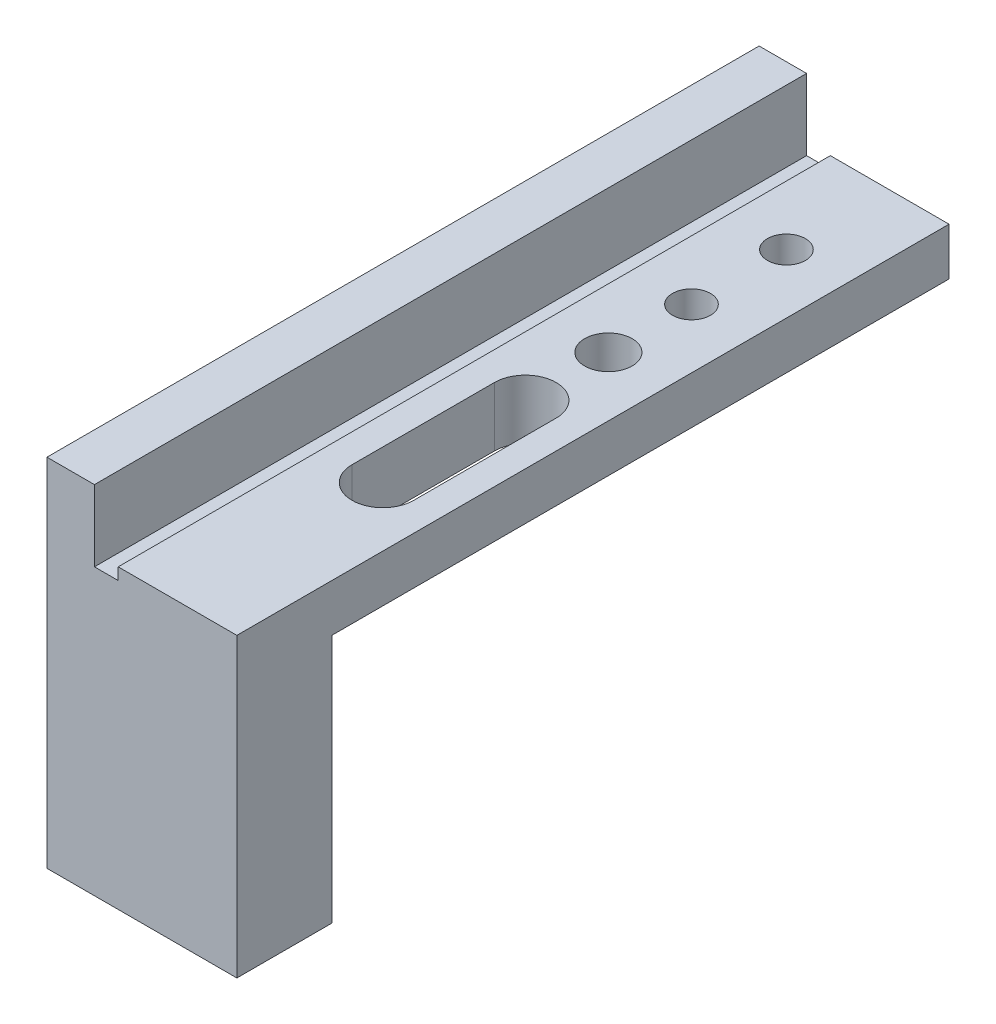
ISO-10303-21;
HEADER;
FILE_DESCRIPTION(('STEP AP214'),'2;1');
FILE_NAME('part.step','',(''),(''),'','','');
FILE_SCHEMA(('AUTOMOTIVE_DESIGN { 1 0 10303 214 1 1 1 1 }'));
ENDSEC;
DATA;
#1=APPLICATION_CONTEXT('core data for automotive mechanical design processes');
#2=APPLICATION_PROTOCOL_DEFINITION('international standard','automotive_design',2000,#1);
#3=PRODUCT_CONTEXT('',#1,'mechanical');
#4=PRODUCT('Part','Part','',(#3));
#5=PRODUCT_RELATED_PRODUCT_CATEGORY('part','',(#4));
#6=PRODUCT_DEFINITION_FORMATION('','',#4);
#7=PRODUCT_DEFINITION_CONTEXT('part definition',#1,'design');
#8=PRODUCT_DEFINITION('design','',#6,#7);
#9=PRODUCT_DEFINITION_SHAPE('','',#8);
#10=(LENGTH_UNIT() NAMED_UNIT(*) SI_UNIT(.MILLI.,.METRE.));
#11=(NAMED_UNIT(*) PLANE_ANGLE_UNIT() SI_UNIT($,.RADIAN.));
#12=(NAMED_UNIT(*) SI_UNIT($,.STERADIAN.) SOLID_ANGLE_UNIT());
#13=UNCERTAINTY_MEASURE_WITH_UNIT(LENGTH_MEASURE(1.E-05),#10,'distance_accuracy_value','');
#14=(GEOMETRIC_REPRESENTATION_CONTEXT(3) GLOBAL_UNCERTAINTY_ASSIGNED_CONTEXT((#13)) GLOBAL_UNIT_ASSIGNED_CONTEXT((#10,
#11,#12)) REPRESENTATION_CONTEXT('',''));
#15=CARTESIAN_POINT('',(0.,0.,0.));
#16=DIRECTION('',(0.,0.,1.));
#17=DIRECTION('',(1.,0.,0.));
#18=AXIS2_PLACEMENT_3D('',#15,#16,#17);
#19=CARTESIAN_POINT('',(-5.15254237288136,-1.99999999999999,30.));
#20=DIRECTION('',(0.,1.,0.));
#21=DIRECTION('',(0.,0.,1.));
#22=AXIS2_PLACEMENT_3D('',#19,#20,#21);
#23=PLANE('',#22);
#24=CARTESIAN_POINT('',(0.347457627118638,-1.99999999999999,11.85));
#25=DIRECTION('',(0.,1.,0.));
#26=DIRECTION('',(0.,0.,1.));
#27=AXIS2_PLACEMENT_3D('',#24,#25,#26);
#28=CIRCLE('',#27,1.);
#29=CARTESIAN_POINT('',(0.347457627118638,-1.99999999999999,12.85));
#30=VERTEX_POINT('',#29);
#31=EDGE_CURVE('E226',#30,#30,#28,.T.);
#32=ORIENTED_EDGE('',*,*,#31,.T.);
#33=EDGE_LOOP('',(#32));
#34=FACE_BOUND('',#33,.T.);
#35=DIRECTION('',(0.,0.,1.));
#36=VECTOR('',#35,1.);
#37=CARTESIAN_POINT('',(-0.952542372881362,-1.99999999999999,30.));
#38=LINE('',#37,#36);
#39=CARTESIAN_POINT('',(-0.952542372881362,-1.99999999999999,15.35));
#40=VERTEX_POINT('',#39);
#41=CARTESIAN_POINT('',(-0.952542372881362,-1.99999999999999,21.35));
#42=VERTEX_POINT('',#41);
#43=EDGE_CURVE('E217',#40,#42,#38,.T.);
#44=ORIENTED_EDGE('',*,*,#43,.T.);
#45=CARTESIAN_POINT('',(0.347457627118638,-1.99999999999999,21.35));
#46=DIRECTION('',(0.,1.,0.));
#47=DIRECTION('',(0.,0.,1.));
#48=AXIS2_PLACEMENT_3D('',#45,#46,#47);
#49=CIRCLE('',#48,1.3);
#50=CARTESIAN_POINT('',(1.64745762711864,-1.99999999999999,21.35));
#51=VERTEX_POINT('',#50);
#52=EDGE_CURVE('E220',#42,#51,#49,.T.);
#53=ORIENTED_EDGE('',*,*,#52,.T.);
#54=DIRECTION('',(0.,0.,-1.));
#55=VECTOR('',#54,1.);
#56=CARTESIAN_POINT('',(1.64745762711864,-1.99999999999999,30.));
#57=LINE('',#56,#55);
#58=CARTESIAN_POINT('',(1.64745762711864,-1.99999999999999,15.35));
#59=VERTEX_POINT('',#58);
#60=EDGE_CURVE('E205',#51,#59,#57,.T.);
#61=ORIENTED_EDGE('',*,*,#60,.T.);
#62=CARTESIAN_POINT('',(0.347457627118638,-1.99999999999999,15.35));
#63=DIRECTION('',(0.,1.,0.));
#64=DIRECTION('',(0.,0.,1.));
#65=AXIS2_PLACEMENT_3D('',#62,#63,#64);
#66=CIRCLE('',#65,1.3);
#67=EDGE_CURVE('E214',#59,#40,#66,.T.);
#68=ORIENTED_EDGE('',*,*,#67,.T.);
#69=EDGE_LOOP('',(#44,#53,#61,#68));
#70=FACE_BOUND('',#69,.T.);
#71=CARTESIAN_POINT('',(0.347457627118638,-1.99999999999999,8.35));
#72=DIRECTION('',(0.,1.,0.));
#73=DIRECTION('',(0.,0.,1.));
#74=AXIS2_PLACEMENT_3D('',#71,#72,#73);
#75=CIRCLE('',#74,0.799999999999997);
#76=CARTESIAN_POINT('',(0.347457627118638,-1.99999999999999,9.15));
#77=VERTEX_POINT('',#76);
#78=EDGE_CURVE('E188',#77,#77,#75,.T.);
#79=ORIENTED_EDGE('',*,*,#78,.T.);
#80=EDGE_LOOP('',(#79));
#81=FACE_BOUND('',#80,.T.);
#82=CARTESIAN_POINT('',(0.347457627118638,-1.99999999999999,4.35));
#83=DIRECTION('',(0.,1.,0.));
#84=DIRECTION('',(0.,0.,1.));
#85=AXIS2_PLACEMENT_3D('',#82,#83,#84);
#86=CIRCLE('',#85,0.799999999999997);
#87=CARTESIAN_POINT('',(0.347457627118638,-1.99999999999999,5.15));
#88=VERTEX_POINT('',#87);
#89=EDGE_CURVE('E182',#88,#88,#86,.T.);
#90=ORIENTED_EDGE('',*,*,#89,.T.);
#91=EDGE_LOOP('',(#90));
#92=FACE_BOUND('',#91,.T.);
#93=DIRECTION('',(1.,0.,0.));
#94=VECTOR('',#93,1.);
#95=CARTESIAN_POINT('',(2.84745762711864,-1.99999999999999,26.));
#96=LINE('',#95,#94);
#97=CARTESIAN_POINT('',(-4.65254237288136,-1.99999999999999,26.));
#98=VERTEX_POINT('',#97);
#99=CARTESIAN_POINT('',(2.34745762711864,-1.99999999999999,26.));
#100=VERTEX_POINT('',#99);
#101=EDGE_CURVE('E170',#98,#100,#96,.T.);
#102=ORIENTED_EDGE('',*,*,#101,.F.);
#103=DIRECTION('',(0.,0.,-1.));
#104=VECTOR('',#103,1.);
#105=CARTESIAN_POINT('',(-4.65254237288136,-1.99999999999999,30.));
#106=LINE('',#105,#104);
#107=CARTESIAN_POINT('',(-4.65254237288136,-1.99999999999999,0.));
#108=VERTEX_POINT('',#107);
#109=EDGE_CURVE('E275',#98,#108,#106,.T.);
#110=ORIENTED_EDGE('',*,*,#109,.T.);
#111=DIRECTION('',(1.,0.,0.));
#112=VECTOR('',#111,1.);
#113=CARTESIAN_POINT('',(-5.15254237288136,-1.99999999999999,0.));
#114=LINE('',#113,#112);
#115=CARTESIAN_POINT('',(2.34745762711864,-1.99999999999999,0.));
#116=VERTEX_POINT('',#115);
#117=EDGE_CURVE('E244',#108,#116,#114,.T.);
#118=ORIENTED_EDGE('',*,*,#117,.T.);
#119=DIRECTION('',(0.,0.,1.));
#120=VECTOR('',#119,1.);
#121=CARTESIAN_POINT('',(2.34745762711864,-1.99999999999999,30.));
#122=LINE('',#121,#120);
#123=EDGE_CURVE('E273',#116,#100,#122,.T.);
#124=ORIENTED_EDGE('',*,*,#123,.T.);
#125=EDGE_LOOP('',(#102,#110,#118,#124));
#126=FACE_BOUND('',#125,.T.);
#127=ADVANCED_FACE('F35',(#34,#70,#81,#92,#126),#23,.F.);
#128=CARTESIAN_POINT('',(-5.15254237288136,3.00000000000001,30.));
#129=DIRECTION('',(1.,0.,0.));
#130=DIRECTION('',(0.,1.,0.));
#131=AXIS2_PLACEMENT_3D('',#128,#129,#130);
#132=PLANE('',#131);
#133=DIRECTION('',(0.,-1.,0.));
#134=VECTOR('',#133,1.);
#135=CARTESIAN_POINT('',(-5.15254237288136,3.00000000000001,0.));
#136=LINE('',#135,#134);
#137=CARTESIAN_POINT('',(-5.15254237288136,3.00000000000001,0.));
#138=VERTEX_POINT('',#137);
#139=CARTESIAN_POINT('',(-5.15254237288136,-1.49999999999999,0.));
#140=VERTEX_POINT('',#139);
#141=EDGE_CURVE('E229',#138,#140,#136,.T.);
#142=ORIENTED_EDGE('',*,*,#141,.T.);
#143=DIRECTION('',(0.,0.,1.));
#144=VECTOR('',#143,1.);
#145=CARTESIAN_POINT('',(-5.15254237288136,-1.49999999999999,30.));
#146=LINE('',#145,#144);
#147=CARTESIAN_POINT('',(-5.15254237288136,-1.49999999999999,26.));
#148=VERTEX_POINT('',#147);
#149=EDGE_CURVE('E282',#140,#148,#146,.T.);
#150=ORIENTED_EDGE('',*,*,#149,.T.);
#151=DIRECTION('',(0.,1.,0.));
#152=VECTOR('',#151,1.);
#153=CARTESIAN_POINT('',(-5.15254237288136,-12.,26.));
#154=LINE('',#153,#152);
#155=CARTESIAN_POINT('',(-5.15254237288136,-12.,26.));
#156=VERTEX_POINT('',#155);
#157=EDGE_CURVE('E57',#156,#148,#154,.T.);
#158=ORIENTED_EDGE('',*,*,#157,.F.);
#159=DIRECTION('',(0.,0.,-1.));
#160=VECTOR('',#159,1.);
#161=CARTESIAN_POINT('',(-5.15254237288136,-12.,30.));
#162=LINE('',#161,#160);
#163=CARTESIAN_POINT('',(-5.15254237288136,-12.,30.));
#164=VERTEX_POINT('',#163);
#165=EDGE_CURVE('E166',#164,#156,#162,.T.);
#166=ORIENTED_EDGE('',*,*,#165,.F.);
#167=DIRECTION('',(0.,-1.,0.));
#168=VECTOR('',#167,1.);
#169=CARTESIAN_POINT('',(-5.15254237288136,3.00000000000001,30.));
#170=LINE('',#169,#168);
#171=CARTESIAN_POINT('',(-5.15254237288136,3.00000000000001,30.));
#172=VERTEX_POINT('',#171);
#173=EDGE_CURVE('E158',#172,#164,#170,.T.);
#174=ORIENTED_EDGE('',*,*,#173,.F.);
#175=DIRECTION('',(0.,0.,-1.));
#176=VECTOR('',#175,1.);
#177=CARTESIAN_POINT('',(-5.15254237288136,3.00000000000001,30.));
#178=LINE('',#177,#176);
#179=EDGE_CURVE('E241',#172,#138,#178,.T.);
#180=ORIENTED_EDGE('',*,*,#179,.T.);
#181=EDGE_LOOP('',(#142,#150,#158,#166,#174,#180));
#182=FACE_BOUND('',#181,.T.);
#183=ADVANCED_FACE('F301',(#182),#132,.F.);
#184=CARTESIAN_POINT('',(2.84745762711864,-1.99999999999999,30.));
#185=DIRECTION('',(-1.,0.,0.));
#186=DIRECTION('',(0.,-1.,0.));
#187=AXIS2_PLACEMENT_3D('',#184,#185,#186);
#188=PLANE('',#187);
#189=DIRECTION('',(0.,1.,0.));
#190=VECTOR('',#189,1.);
#191=CARTESIAN_POINT('',(2.84745762711864,-12.,26.));
#192=LINE('',#191,#190);
#193=CARTESIAN_POINT('',(2.84745762711864,-12.,26.));
#194=VERTEX_POINT('',#193);
#195=CARTESIAN_POINT('',(2.84745762711864,-1.5,26.));
#196=VERTEX_POINT('',#195);
#197=EDGE_CURVE('E50',#194,#196,#192,.T.);
#198=ORIENTED_EDGE('',*,*,#197,.T.);
#199=DIRECTION('',(0.,0.,-1.));
#200=VECTOR('',#199,1.);
#201=CARTESIAN_POINT('',(2.84745762711864,-1.5,30.));
#202=LINE('',#201,#200);
#203=CARTESIAN_POINT('',(2.84745762711864,-1.5,0.));
#204=VERTEX_POINT('',#203);
#205=EDGE_CURVE('E284',#196,#204,#202,.T.);
#206=ORIENTED_EDGE('',*,*,#205,.T.);
#207=DIRECTION('',(0.,1.,0.));
#208=VECTOR('',#207,1.);
#209=CARTESIAN_POINT('',(2.84745762711864,-1.99999999999999,0.));
#210=LINE('',#209,#208);
#211=CARTESIAN_POINT('',(2.84745762711864,0.500000000000006,0.));
#212=VERTEX_POINT('',#211);
#213=EDGE_CURVE('E247',#204,#212,#210,.T.);
#214=ORIENTED_EDGE('',*,*,#213,.T.);
#215=DIRECTION('',(0.,0.,-1.));
#216=VECTOR('',#215,1.);
#217=CARTESIAN_POINT('',(2.84745762711864,0.500000000000006,30.));
#218=LINE('',#217,#216);
#219=CARTESIAN_POINT('',(2.84745762711864,0.500000000000006,30.));
#220=VERTEX_POINT('',#219);
#221=EDGE_CURVE('E154',#220,#212,#218,.T.);
#222=ORIENTED_EDGE('',*,*,#221,.F.);
#223=DIRECTION('',(0.,1.,0.));
#224=VECTOR('',#223,1.);
#225=CARTESIAN_POINT('',(2.84745762711864,-1.99999999999999,30.));
#226=LINE('',#225,#224);
#227=CARTESIAN_POINT('',(2.84745762711864,-12.,30.));
#228=VERTEX_POINT('',#227);
#229=EDGE_CURVE('E148',#228,#220,#226,.T.);
#230=ORIENTED_EDGE('',*,*,#229,.F.);
#231=DIRECTION('',(0.,0.,1.));
#232=VECTOR('',#231,1.);
#233=CARTESIAN_POINT('',(2.84745762711864,-12.,30.));
#234=LINE('',#233,#232);
#235=EDGE_CURVE('E152',#194,#228,#234,.T.);
#236=ORIENTED_EDGE('',*,*,#235,.F.);
#237=EDGE_LOOP('',(#198,#206,#214,#222,#230,#236));
#238=FACE_BOUND('',#237,.T.);
#239=ADVANCED_FACE('F150',(#238),#188,.F.);
#240=CARTESIAN_POINT('',(-2.15254237288136,0.500000000000005,30.));
#241=DIRECTION('',(0.,-1.,0.));
#242=DIRECTION('',(1.,0.,0.));
#243=AXIS2_PLACEMENT_3D('',#240,#241,#242);
#244=PLANE('',#243);
#245=CARTESIAN_POINT('',(0.347457627118638,0.500000000000006,4.35));
#246=DIRECTION('',(0.,1.,0.));
#247=DIRECTION('',(0.,0.,1.));
#248=AXIS2_PLACEMENT_3D('',#245,#246,#247);
#249=CIRCLE('',#248,0.799999999999998);
#250=CARTESIAN_POINT('',(0.347457627118638,0.500000000000006,5.15));
#251=VERTEX_POINT('',#250);
#252=EDGE_CURVE('E179',#251,#251,#249,.T.);
#253=ORIENTED_EDGE('',*,*,#252,.F.);
#254=EDGE_LOOP('',(#253));
#255=FACE_BOUND('',#254,.T.);
#256=CARTESIAN_POINT('',(0.347457627118638,0.500000000000006,8.35));
#257=DIRECTION('',(0.,1.,0.));
#258=DIRECTION('',(0.,0.,1.));
#259=AXIS2_PLACEMENT_3D('',#256,#257,#258);
#260=CIRCLE('',#259,0.799999999999998);
#261=CARTESIAN_POINT('',(0.347457627118638,0.500000000000006,9.15));
#262=VERTEX_POINT('',#261);
#263=EDGE_CURVE('E185',#262,#262,#260,.T.);
#264=ORIENTED_EDGE('',*,*,#263,.F.);
#265=EDGE_LOOP('',(#264));
#266=FACE_BOUND('',#265,.T.);
#267=DIRECTION('',(0.,0.,-1.));
#268=VECTOR('',#267,1.);
#269=CARTESIAN_POINT('',(1.64745762711864,0.500000000000006,21.35));
#270=LINE('',#269,#268);
#271=CARTESIAN_POINT('',(1.64745762711864,0.500000000000006,21.35));
#272=VERTEX_POINT('',#271);
#273=CARTESIAN_POINT('',(1.64745762711864,0.500000000000006,15.35));
#274=VERTEX_POINT('',#273);
#275=EDGE_CURVE('E193',#272,#274,#270,.T.);
#276=ORIENTED_EDGE('',*,*,#275,.F.);
#277=CARTESIAN_POINT('',(0.347457627118638,0.500000000000006,21.35));
#278=DIRECTION('',(0.,1.,0.));
#279=DIRECTION('',(-1.,0.,0.));
#280=AXIS2_PLACEMENT_3D('',#277,#278,#279);
#281=CIRCLE('',#280,1.3);
#282=CARTESIAN_POINT('',(-0.952542372881362,0.500000000000005,21.35));
#283=VERTEX_POINT('',#282);
#284=EDGE_CURVE('E191',#283,#272,#281,.T.);
#285=ORIENTED_EDGE('',*,*,#284,.F.);
#286=DIRECTION('',(0.,0.,1.));
#287=VECTOR('',#286,1.);
#288=CARTESIAN_POINT('',(-0.952542372881362,0.500000000000005,21.35));
#289=LINE('',#288,#287);
#290=CARTESIAN_POINT('',(-0.952542372881362,0.500000000000005,15.35));
#291=VERTEX_POINT('',#290);
#292=EDGE_CURVE('E199',#291,#283,#289,.T.);
#293=ORIENTED_EDGE('',*,*,#292,.F.);
#294=CARTESIAN_POINT('',(0.347457627118638,0.500000000000006,15.35));
#295=DIRECTION('',(0.,1.,0.));
#296=DIRECTION('',(-1.,0.,0.));
#297=AXIS2_PLACEMENT_3D('',#294,#295,#296);
#298=CIRCLE('',#297,1.3);
#299=EDGE_CURVE('E196',#274,#291,#298,.T.);
#300=ORIENTED_EDGE('',*,*,#299,.F.);
#301=EDGE_LOOP('',(#276,#285,#293,#300));
#302=FACE_BOUND('',#301,.T.);
#303=CARTESIAN_POINT('',(0.347457627118638,0.500000000000006,11.85));
#304=DIRECTION('',(0.,1.,0.));
#305=DIRECTION('',(-1.,0.,0.));
#306=AXIS2_PLACEMENT_3D('',#303,#304,#305);
#307=CIRCLE('',#306,1.);
#308=CARTESIAN_POINT('',(-0.652542372881363,0.500000000000005,11.85));
#309=VERTEX_POINT('',#308);
#310=EDGE_CURVE('E223',#309,#309,#307,.T.);
#311=ORIENTED_EDGE('',*,*,#310,.F.);
#312=EDGE_LOOP('',(#311));
#313=FACE_BOUND('',#312,.T.);
#314=DIRECTION('',(-1.,0.,0.));
#315=VECTOR('',#314,1.);
#316=CARTESIAN_POINT('',(-2.15254237288136,0.500000000000005,0.));
#317=LINE('',#316,#315);
#318=CARTESIAN_POINT('',(-2.15254237288136,0.500000000000005,0.));
#319=VERTEX_POINT('',#318);
#320=EDGE_CURVE('E249',#212,#319,#317,.T.);
#321=ORIENTED_EDGE('',*,*,#320,.T.);
#322=DIRECTION('',(0.,0.,-1.));
#323=VECTOR('',#322,1.);
#324=CARTESIAN_POINT('',(-2.15254237288136,0.500000000000005,30.));
#325=LINE('',#324,#323);
#326=CARTESIAN_POINT('',(-2.15254237288136,0.500000000000005,30.));
#327=VERTEX_POINT('',#326);
#328=EDGE_CURVE('E269',#327,#319,#325,.T.);
#329=ORIENTED_EDGE('',*,*,#328,.F.);
#330=DIRECTION('',(-1.,0.,0.));
#331=VECTOR('',#330,1.);
#332=CARTESIAN_POINT('',(-2.15254237288136,0.500000000000005,30.));
#333=LINE('',#332,#331);
#334=EDGE_CURVE('E157',#220,#327,#333,.T.);
#335=ORIENTED_EDGE('',*,*,#334,.F.);
#336=ORIENTED_EDGE('',*,*,#221,.T.);
#337=EDGE_LOOP('',(#321,#329,#335,#336));
#338=FACE_BOUND('',#337,.T.);
#339=ADVANCED_FACE('F325',(#255,#266,#302,#313,#338),#244,.F.);
#340=CARTESIAN_POINT('',(-2.15254237288136,0.,30.));
#341=DIRECTION('',(1.,0.,0.));
#342=DIRECTION('',(0.,0.,-1.));
#343=AXIS2_PLACEMENT_3D('',#340,#341,#342);
#344=PLANE('',#343);
#345=DIRECTION('',(0.,-1.,0.));
#346=VECTOR('',#345,1.);
#347=CARTESIAN_POINT('',(-2.15254237288136,0.,0.));
#348=LINE('',#347,#346);
#349=CARTESIAN_POINT('',(-2.15254237288136,0.,0.));
#350=VERTEX_POINT('',#349);
#351=EDGE_CURVE('E251',#319,#350,#348,.T.);
#352=ORIENTED_EDGE('',*,*,#351,.T.);
#353=DIRECTION('',(0.,0.,-1.));
#354=VECTOR('',#353,1.);
#355=CARTESIAN_POINT('',(-2.15254237288136,0.,30.));
#356=LINE('',#355,#354);
#357=CARTESIAN_POINT('',(-2.15254237288136,0.,30.));
#358=VERTEX_POINT('',#357);
#359=EDGE_CURVE('E266',#358,#350,#356,.T.);
#360=ORIENTED_EDGE('',*,*,#359,.F.);
#361=DIRECTION('',(0.,-1.,0.));
#362=VECTOR('',#361,1.);
#363=CARTESIAN_POINT('',(-2.15254237288136,0.,30.));
#364=LINE('',#363,#362);
#365=EDGE_CURVE('E233',#327,#358,#364,.T.);
#366=ORIENTED_EDGE('',*,*,#365,.F.);
#367=ORIENTED_EDGE('',*,*,#328,.T.);
#368=EDGE_LOOP('',(#352,#360,#366,#367));
#369=FACE_BOUND('',#368,.T.);
#370=ADVANCED_FACE('F320',(#369),#344,.F.);
#371=CARTESIAN_POINT('',(-3.15254237288136,0.,30.));
#372=DIRECTION('',(0.,-1.,0.));
#373=DIRECTION('',(0.,0.,-1.));
#374=AXIS2_PLACEMENT_3D('',#371,#372,#373);
#375=PLANE('',#374);
#376=DIRECTION('',(-1.,0.,0.));
#377=VECTOR('',#376,1.);
#378=CARTESIAN_POINT('',(-3.15254237288136,0.,0.));
#379=LINE('',#378,#377);
#380=CARTESIAN_POINT('',(-3.15254237288136,0.,0.));
#381=VERTEX_POINT('',#380);
#382=EDGE_CURVE('E253',#350,#381,#379,.T.);
#383=ORIENTED_EDGE('',*,*,#382,.T.);
#384=DIRECTION('',(0.,0.,-1.));
#385=VECTOR('',#384,1.);
#386=CARTESIAN_POINT('',(-3.15254237288136,0.,30.));
#387=LINE('',#386,#385);
#388=CARTESIAN_POINT('',(-3.15254237288136,0.,30.));
#389=VERTEX_POINT('',#388);
#390=EDGE_CURVE('E263',#389,#381,#387,.T.);
#391=ORIENTED_EDGE('',*,*,#390,.F.);
#392=DIRECTION('',(-1.,0.,0.));
#393=VECTOR('',#392,1.);
#394=CARTESIAN_POINT('',(-3.15254237288136,0.,30.));
#395=LINE('',#394,#393);
#396=EDGE_CURVE('E235',#358,#389,#395,.T.);
#397=ORIENTED_EDGE('',*,*,#396,.F.);
#398=ORIENTED_EDGE('',*,*,#359,.T.);
#399=EDGE_LOOP('',(#383,#391,#397,#398));
#400=FACE_BOUND('',#399,.T.);
#401=ADVANCED_FACE('F316',(#400),#375,.F.);
#402=CARTESIAN_POINT('',(-3.15254237288136,3.00000000000001,30.));
#403=DIRECTION('',(-1.,0.,0.));
#404=DIRECTION('',(0.,-1.,0.));
#405=AXIS2_PLACEMENT_3D('',#402,#403,#404);
#406=PLANE('',#405);
#407=DIRECTION('',(0.,1.,0.));
#408=VECTOR('',#407,1.);
#409=CARTESIAN_POINT('',(-3.15254237288136,3.00000000000001,0.));
#410=LINE('',#409,#408);
#411=CARTESIAN_POINT('',(-3.15254237288136,3.00000000000001,0.));
#412=VERTEX_POINT('',#411);
#413=EDGE_CURVE('E255',#381,#412,#410,.T.);
#414=ORIENTED_EDGE('',*,*,#413,.T.);
#415=DIRECTION('',(0.,0.,-1.));
#416=VECTOR('',#415,1.);
#417=CARTESIAN_POINT('',(-3.15254237288136,3.00000000000001,30.));
#418=LINE('',#417,#416);
#419=CARTESIAN_POINT('',(-3.15254237288136,3.00000000000001,30.));
#420=VERTEX_POINT('',#419);
#421=EDGE_CURVE('E260',#420,#412,#418,.T.);
#422=ORIENTED_EDGE('',*,*,#421,.F.);
#423=DIRECTION('',(0.,1.,0.));
#424=VECTOR('',#423,1.);
#425=CARTESIAN_POINT('',(-3.15254237288136,3.00000000000001,30.));
#426=LINE('',#425,#424);
#427=EDGE_CURVE('E237',#389,#420,#426,.T.);
#428=ORIENTED_EDGE('',*,*,#427,.F.);
#429=ORIENTED_EDGE('',*,*,#390,.T.);
#430=EDGE_LOOP('',(#414,#422,#428,#429));
#431=FACE_BOUND('',#430,.T.);
#432=ADVANCED_FACE('F311',(#431),#406,.F.);
#433=CARTESIAN_POINT('',(-5.15254237288136,3.00000000000001,30.));
#434=DIRECTION('',(0.,-1.,0.));
#435=DIRECTION('',(0.,0.,-1.));
#436=AXIS2_PLACEMENT_3D('',#433,#434,#435);
#437=PLANE('',#436);
#438=DIRECTION('',(-1.,0.,0.));
#439=VECTOR('',#438,1.);
#440=CARTESIAN_POINT('',(-5.15254237288136,3.00000000000001,0.));
#441=LINE('',#440,#439);
#442=EDGE_CURVE('E230',#412,#138,#441,.T.);
#443=ORIENTED_EDGE('',*,*,#442,.T.);
#444=ORIENTED_EDGE('',*,*,#179,.F.);
#445=DIRECTION('',(-1.,0.,0.));
#446=VECTOR('',#445,1.);
#447=CARTESIAN_POINT('',(-5.15254237288136,3.00000000000001,30.));
#448=LINE('',#447,#446);
#449=EDGE_CURVE('E239',#420,#172,#448,.T.);
#450=ORIENTED_EDGE('',*,*,#449,.F.);
#451=ORIENTED_EDGE('',*,*,#421,.T.);
#452=EDGE_LOOP('',(#443,#444,#450,#451));
#453=FACE_BOUND('',#452,.T.);
#454=ADVANCED_FACE('F305',(#453),#437,.F.);
#455=CARTESIAN_POINT('',(0.,0.,30.));
#456=DIRECTION('',(0.,0.,1.));
#457=DIRECTION('',(1.,0.,0.));
#458=AXIS2_PLACEMENT_3D('',#455,#456,#457);
#459=PLANE('',#458);
#460=ORIENTED_EDGE('',*,*,#173,.T.);
#461=DIRECTION('',(-1.,0.,0.));
#462=VECTOR('',#461,1.);
#463=CARTESIAN_POINT('',(2.84745762711864,-12.,30.));
#464=LINE('',#463,#462);
#465=EDGE_CURVE('E161',#228,#164,#464,.T.);
#466=ORIENTED_EDGE('',*,*,#465,.F.);
#467=ORIENTED_EDGE('',*,*,#229,.T.);
#468=ORIENTED_EDGE('',*,*,#334,.T.);
#469=ORIENTED_EDGE('',*,*,#365,.T.);
#470=ORIENTED_EDGE('',*,*,#396,.T.);
#471=ORIENTED_EDGE('',*,*,#427,.T.);
#472=ORIENTED_EDGE('',*,*,#449,.T.);
#473=EDGE_LOOP('',(#460,#466,#467,#468,#469,#470,#471,#472));
#474=FACE_BOUND('',#473,.T.);
#475=ADVANCED_FACE('F162',(#474),#459,.T.);
#476=CARTESIAN_POINT('',(0.,0.,0.));
#477=DIRECTION('',(0.,0.,1.));
#478=DIRECTION('',(1.,0.,0.));
#479=AXIS2_PLACEMENT_3D('',#476,#477,#478);
#480=PLANE('',#479);
#481=ORIENTED_EDGE('',*,*,#117,.F.);
#482=DIRECTION('',(0.707106781186545,-0.70710678118655,0.));
#483=VECTOR('',#482,1.);
#484=CARTESIAN_POINT('',(-4.65254237288136,-1.99999999999999,0.));
#485=LINE('',#484,#483);
#486=EDGE_CURVE('E280',#108,#140,#485,.F.);
#487=ORIENTED_EDGE('',*,*,#486,.T.);
#488=ORIENTED_EDGE('',*,*,#141,.F.);
#489=ORIENTED_EDGE('',*,*,#442,.F.);
#490=ORIENTED_EDGE('',*,*,#413,.F.);
#491=ORIENTED_EDGE('',*,*,#382,.F.);
#492=ORIENTED_EDGE('',*,*,#351,.F.);
#493=ORIENTED_EDGE('',*,*,#320,.F.);
#494=ORIENTED_EDGE('',*,*,#213,.F.);
#495=DIRECTION('',(0.70710678118655,0.707106781186545,0.));
#496=VECTOR('',#495,1.);
#497=CARTESIAN_POINT('',(2.84745762711864,-1.5,0.));
#498=LINE('',#497,#496);
#499=EDGE_CURVE('E278',#204,#116,#498,.F.);
#500=ORIENTED_EDGE('',*,*,#499,.T.);
#501=EDGE_LOOP('',(#481,#487,#488,#489,#490,#491,#492,#493,#494,#500));
#502=FACE_BOUND('',#501,.T.);
#503=ADVANCED_FACE('F298',(#502),#480,.F.);
#504=CARTESIAN_POINT('',(0.34745762711864,-9.49999999999999,11.85));
#505=DIRECTION('',(0.,1.,0.));
#506=DIRECTION('',(-1.,0.,0.));
#507=AXIS2_PLACEMENT_3D('',#504,#505,#506);
#508=CYLINDRICAL_SURFACE('',#507,1.);
#509=ORIENTED_EDGE('',*,*,#310,.T.);
#510=EDGE_LOOP('',(#509));
#511=FACE_BOUND('',#510,.T.);
#512=ORIENTED_EDGE('',*,*,#31,.F.);
#513=EDGE_LOOP('',(#512));
#514=FACE_BOUND('',#513,.T.);
#515=ADVANCED_FACE('F380',(#511,#514),#508,.F.);
#516=CARTESIAN_POINT('',(0.34745762711864,-9.49999999999999,21.35));
#517=DIRECTION('',(0.,1.,0.));
#518=DIRECTION('',(-1.,0.,0.));
#519=AXIS2_PLACEMENT_3D('',#516,#517,#518);
#520=CYLINDRICAL_SURFACE('',#519,1.3);
#521=DIRECTION('',(0.,1.,0.));
#522=VECTOR('',#521,1.);
#523=CARTESIAN_POINT('',(-0.95254237288136,-9.49999999999999,21.35));
#524=LINE('',#523,#522);
#525=EDGE_CURVE('E203',#42,#283,#524,.T.);
#526=ORIENTED_EDGE('',*,*,#525,.T.);
#527=ORIENTED_EDGE('',*,*,#284,.T.);
#528=DIRECTION('',(0.,1.,0.));
#529=VECTOR('',#528,1.);
#530=CARTESIAN_POINT('',(1.64745762711864,-9.49999999999999,21.35));
#531=LINE('',#530,#529);
#532=EDGE_CURVE('E202',#51,#272,#531,.T.);
#533=ORIENTED_EDGE('',*,*,#532,.F.);
#534=ORIENTED_EDGE('',*,*,#52,.F.);
#535=EDGE_LOOP('',(#526,#527,#533,#534));
#536=FACE_BOUND('',#535,.T.);
#537=ADVANCED_FACE('F370',(#536),#520,.F.);
#538=CARTESIAN_POINT('',(-0.95254237288136,-9.49999999999999,21.35));
#539=DIRECTION('',(-1.,0.,0.));
#540=DIRECTION('',(0.,-1.,0.));
#541=AXIS2_PLACEMENT_3D('',#538,#539,#540);
#542=PLANE('',#541);
#543=DIRECTION('',(0.,1.,0.));
#544=VECTOR('',#543,1.);
#545=CARTESIAN_POINT('',(-0.95254237288136,-9.49999999999999,15.35));
#546=LINE('',#545,#544);
#547=EDGE_CURVE('E206',#40,#291,#546,.T.);
#548=ORIENTED_EDGE('',*,*,#547,.T.);
#549=ORIENTED_EDGE('',*,*,#292,.T.);
#550=ORIENTED_EDGE('',*,*,#525,.F.);
#551=ORIENTED_EDGE('',*,*,#43,.F.);
#552=EDGE_LOOP('',(#548,#549,#550,#551));
#553=FACE_BOUND('',#552,.T.);
#554=ADVANCED_FACE('F366',(#553),#542,.F.);
#555=CARTESIAN_POINT('',(0.34745762711864,-9.49999999999999,15.35));
#556=DIRECTION('',(0.,1.,0.));
#557=DIRECTION('',(-1.,0.,0.));
#558=AXIS2_PLACEMENT_3D('',#555,#556,#557);
#559=CYLINDRICAL_SURFACE('',#558,1.3);
#560=DIRECTION('',(0.,1.,0.));
#561=VECTOR('',#560,1.);
#562=CARTESIAN_POINT('',(1.64745762711864,-9.49999999999999,15.35));
#563=LINE('',#562,#561);
#564=EDGE_CURVE('E208',#59,#274,#563,.T.);
#565=ORIENTED_EDGE('',*,*,#564,.T.);
#566=ORIENTED_EDGE('',*,*,#299,.T.);
#567=ORIENTED_EDGE('',*,*,#547,.F.);
#568=ORIENTED_EDGE('',*,*,#67,.F.);
#569=EDGE_LOOP('',(#565,#566,#567,#568));
#570=FACE_BOUND('',#569,.T.);
#571=ADVANCED_FACE('F369',(#570),#559,.F.);
#572=CARTESIAN_POINT('',(1.64745762711864,-9.49999999999999,21.35));
#573=DIRECTION('',(1.,0.,0.));
#574=DIRECTION('',(0.,1.,0.));
#575=AXIS2_PLACEMENT_3D('',#572,#573,#574);
#576=PLANE('',#575);
#577=ORIENTED_EDGE('',*,*,#532,.T.);
#578=ORIENTED_EDGE('',*,*,#275,.T.);
#579=ORIENTED_EDGE('',*,*,#564,.F.);
#580=ORIENTED_EDGE('',*,*,#60,.F.);
#581=EDGE_LOOP('',(#577,#578,#579,#580));
#582=FACE_BOUND('',#581,.T.);
#583=ADVANCED_FACE('F364',(#582),#576,.F.);
#584=CARTESIAN_POINT('',(0.347457627118638,0.500000000000006,8.35));
#585=DIRECTION('',(0.,1.,0.));
#586=DIRECTION('',(0.,0.,1.));
#587=AXIS2_PLACEMENT_3D('',#584,#585,#586);
#588=CYLINDRICAL_SURFACE('',#587,0.799999999999997);
#589=ORIENTED_EDGE('',*,*,#263,.T.);
#590=EDGE_LOOP('',(#589));
#591=FACE_BOUND('',#590,.T.);
#592=ORIENTED_EDGE('',*,*,#78,.F.);
#593=EDGE_LOOP('',(#592));
#594=FACE_BOUND('',#593,.T.);
#595=ADVANCED_FACE('F360',(#591,#594),#588,.F.);
#596=CARTESIAN_POINT('',(0.347457627118638,0.500000000000006,4.35));
#597=DIRECTION('',(0.,1.,0.));
#598=DIRECTION('',(0.,0.,1.));
#599=AXIS2_PLACEMENT_3D('',#596,#597,#598);
#600=CYLINDRICAL_SURFACE('',#599,0.799999999999997);
#601=ORIENTED_EDGE('',*,*,#252,.T.);
#602=EDGE_LOOP('',(#601));
#603=FACE_BOUND('',#602,.T.);
#604=ORIENTED_EDGE('',*,*,#89,.F.);
#605=EDGE_LOOP('',(#604));
#606=FACE_BOUND('',#605,.T.);
#607=ADVANCED_FACE('F355',(#603,#606),#600,.F.);
#608=CARTESIAN_POINT('',(2.84745762711864,-12.,26.));
#609=DIRECTION('',(0.,0.,1.));
#610=DIRECTION('',(1.,0.,0.));
#611=AXIS2_PLACEMENT_3D('',#608,#609,#610);
#612=PLANE('',#611);
#613=ORIENTED_EDGE('',*,*,#157,.T.);
#614=DIRECTION('',(-0.707106781186545,0.70710678118655,0.));
#615=VECTOR('',#614,1.);
#616=CARTESIAN_POINT('',(4.09745762711861,-10.75,26.));
#617=LINE('',#616,#615);
#618=EDGE_CURVE('E43',#148,#98,#617,.F.);
#619=ORIENTED_EDGE('',*,*,#618,.T.);
#620=ORIENTED_EDGE('',*,*,#101,.T.);
#621=DIRECTION('',(-0.70710678118655,-0.707106781186545,0.));
#622=VECTOR('',#621,1.);
#623=CARTESIAN_POINT('',(-2.40254237288136,-6.74999999999996,26.));
#624=LINE('',#623,#622);
#625=EDGE_CURVE('E11',#100,#196,#624,.F.);
#626=ORIENTED_EDGE('',*,*,#625,.T.);
#627=ORIENTED_EDGE('',*,*,#197,.F.);
#628=DIRECTION('',(1.,0.,0.));
#629=VECTOR('',#628,1.);
#630=CARTESIAN_POINT('',(2.84745762711864,-12.,26.));
#631=LINE('',#630,#629);
#632=EDGE_CURVE('E169',#156,#194,#631,.T.);
#633=ORIENTED_EDGE('',*,*,#632,.F.);
#634=EDGE_LOOP('',(#613,#619,#620,#626,#627,#633));
#635=FACE_BOUND('',#634,.T.);
#636=ADVANCED_FACE('F287',(#635),#612,.F.);
#637=CARTESIAN_POINT('',(0.,-12.,0.));
#638=DIRECTION('',(0.,1.,0.));
#639=DIRECTION('',(0.,0.,1.));
#640=AXIS2_PLACEMENT_3D('',#637,#638,#639);
#641=PLANE('',#640);
#642=ORIENTED_EDGE('',*,*,#235,.T.);
#643=ORIENTED_EDGE('',*,*,#465,.T.);
#644=ORIENTED_EDGE('',*,*,#165,.T.);
#645=ORIENTED_EDGE('',*,*,#632,.T.);
#646=EDGE_LOOP('',(#642,#643,#644,#645));
#647=FACE_BOUND('',#646,.T.);
#648=ADVANCED_FACE('F168',(#647),#641,.F.);
#649=CARTESIAN_POINT('',(-4.65254237288136,-1.99999999999999,30.));
#650=DIRECTION('',(0.70710678118655,0.707106781186545,0.));
#651=DIRECTION('',(0.,0.,-1.));
#652=AXIS2_PLACEMENT_3D('',#649,#650,#651);
#653=PLANE('',#652);
#654=ORIENTED_EDGE('',*,*,#618,.F.);
#655=ORIENTED_EDGE('',*,*,#149,.F.);
#656=ORIENTED_EDGE('',*,*,#486,.F.);
#657=ORIENTED_EDGE('',*,*,#109,.F.);
#658=EDGE_LOOP('',(#654,#655,#656,#657));
#659=FACE_BOUND('',#658,.T.);
#660=ADVANCED_FACE('F295',(#659),#653,.F.);
#661=CARTESIAN_POINT('',(2.84745762711864,-1.5,30.));
#662=DIRECTION('',(-0.707106781186545,0.70710678118655,0.));
#663=DIRECTION('',(0.,0.,-1.));
#664=AXIS2_PLACEMENT_3D('',#661,#662,#663);
#665=PLANE('',#664);
#666=ORIENTED_EDGE('',*,*,#625,.F.);
#667=ORIENTED_EDGE('',*,*,#123,.F.);
#668=ORIENTED_EDGE('',*,*,#499,.F.);
#669=ORIENTED_EDGE('',*,*,#205,.F.);
#670=EDGE_LOOP('',(#666,#667,#668,#669));
#671=FACE_BOUND('',#670,.T.);
#672=ADVANCED_FACE('F37',(#671),#665,.F.);
#673=CLOSED_SHELL('',(#127,#183,#239,#339,#370,#401,#432,#454,#475,#503,#515,#537,#554,#571,
#583,#595,#607,#636,#648,#660,#672));
#674=MANIFOLD_SOLID_BREP('B2',#673);
#675=ADVANCED_BREP_SHAPE_REPRESENTATION('',(#18,#674),#14);
#676=SHAPE_DEFINITION_REPRESENTATION(#9,#675);
ENDSEC;
END-ISO-10303-21;
